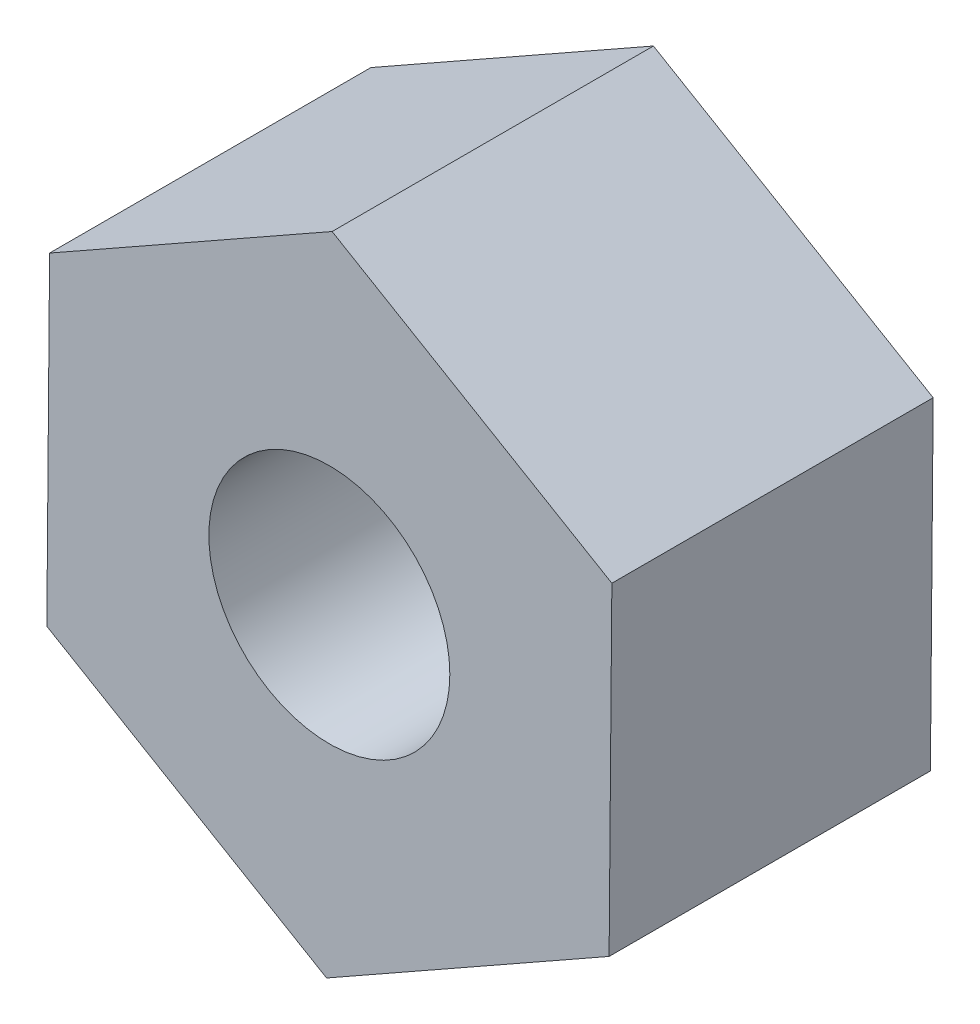
ISO-10303-21;
HEADER;
FILE_DESCRIPTION(('STEP AP214'),'2;1');
FILE_NAME('part.step','',(''),(''),'','','');
FILE_SCHEMA(('AUTOMOTIVE_DESIGN { 1 0 10303 214 1 1 1 1 }'));
ENDSEC;
DATA;
#1=APPLICATION_CONTEXT('core data for automotive mechanical design processes');
#2=APPLICATION_PROTOCOL_DEFINITION('international standard','automotive_design',2000,#1);
#3=PRODUCT_CONTEXT('',#1,'mechanical');
#4=PRODUCT('Part','Part','',(#3));
#5=PRODUCT_RELATED_PRODUCT_CATEGORY('part','',(#4));
#6=PRODUCT_DEFINITION_FORMATION('','',#4);
#7=PRODUCT_DEFINITION_CONTEXT('part definition',#1,'design');
#8=PRODUCT_DEFINITION('design','',#6,#7);
#9=PRODUCT_DEFINITION_SHAPE('','',#8);
#10=(LENGTH_UNIT() NAMED_UNIT(*) SI_UNIT(.MILLI.,.METRE.));
#11=(NAMED_UNIT(*) PLANE_ANGLE_UNIT() SI_UNIT($,.RADIAN.));
#12=(NAMED_UNIT(*) SI_UNIT($,.STERADIAN.) SOLID_ANGLE_UNIT());
#13=UNCERTAINTY_MEASURE_WITH_UNIT(LENGTH_MEASURE(1.E-05),#10,'distance_accuracy_value','');
#14=(GEOMETRIC_REPRESENTATION_CONTEXT(3) GLOBAL_UNCERTAINTY_ASSIGNED_CONTEXT((#13)) GLOBAL_UNIT_ASSIGNED_CONTEXT((#10,
#11,#12)) REPRESENTATION_CONTEXT('',''));
#15=CARTESIAN_POINT('',(0.,0.,0.));
#16=DIRECTION('',(0.,0.,1.));
#17=DIRECTION('',(1.,0.,0.));
#18=AXIS2_PLACEMENT_3D('',#15,#16,#17);
#19=CARTESIAN_POINT('',(0.,0.,4.));
#20=DIRECTION('',(0.,0.,1.));
#21=DIRECTION('',(1.,0.,0.));
#22=AXIS2_PLACEMENT_3D('',#19,#20,#21);
#23=PLANE('',#22);
#24=DIRECTION('',(-0.870254256512063,-0.492602810611792,0.));
#25=VECTOR('',#24,1.);
#26=CARTESIAN_POINT('',(0.0344355152710264,4.04130517637822,4.));
#27=LINE('',#26,#25);
#28=CARTESIAN_POINT('',(0.0344355152710264,4.04130517637822,4.));
#29=VERTEX_POINT('',#28);
#30=CARTESIAN_POINT('',(-3.48265518955357,2.05047461920622,4.));
#31=VERTEX_POINT('',#30);
#32=EDGE_CURVE('E129',#29,#31,#27,.T.);
#33=ORIENTED_EDGE('',*,*,#32,.T.);
#34=DIRECTION('',(-0.00852058029060413,-0.999963699196882,0.));
#35=VECTOR('',#34,1.);
#36=CARTESIAN_POINT('',(-3.48265518955357,2.05047461920622,4.));
#37=LINE('',#36,#35);
#38=CARTESIAN_POINT('',(-3.5170907048246,-1.99083055717199,4.));
#39=VERTEX_POINT('',#38);
#40=EDGE_CURVE('E87',#31,#39,#37,.T.);
#41=ORIENTED_EDGE('',*,*,#40,.T.);
#42=DIRECTION('',(0.861733676221458,-0.507360888585089,0.));
#43=VECTOR('',#42,1.);
#44=CARTESIAN_POINT('',(-3.5170907048246,-1.99083055717199,4.));
#45=LINE('',#44,#43);
#46=CARTESIAN_POINT('',(-0.0344355152710244,-4.04130517637822,4.));
#47=VERTEX_POINT('',#46);
#48=EDGE_CURVE('E100',#39,#47,#45,.T.);
#49=ORIENTED_EDGE('',*,*,#48,.T.);
#50=DIRECTION('',(0.870254256512062,0.492602810611792,0.));
#51=VECTOR('',#50,1.);
#52=CARTESIAN_POINT('',(-0.0344355152710244,-4.04130517637822,4.));
#53=LINE('',#52,#51);
#54=CARTESIAN_POINT('',(3.48265518955357,-2.05047461920622,4.));
#55=VERTEX_POINT('',#54);
#56=EDGE_CURVE('E94',#47,#55,#53,.T.);
#57=ORIENTED_EDGE('',*,*,#56,.T.);
#58=DIRECTION('',(0.00852058029060424,0.999963699196882,0.));
#59=VECTOR('',#58,1.);
#60=CARTESIAN_POINT('',(3.48265518955357,-2.05047461920622,4.));
#61=LINE('',#60,#59);
#62=CARTESIAN_POINT('',(3.5170907048246,1.99083055717199,4.));
#63=VERTEX_POINT('',#62);
#64=EDGE_CURVE('E98',#55,#63,#61,.T.);
#65=ORIENTED_EDGE('',*,*,#64,.T.);
#66=DIRECTION('',(-0.861733676221458,0.507360888585089,0.));
#67=VECTOR('',#66,1.);
#68=CARTESIAN_POINT('',(3.5170907048246,1.99083055717199,4.));
#69=LINE('',#68,#67);
#70=EDGE_CURVE('E50',#63,#29,#69,.T.);
#71=ORIENTED_EDGE('',*,*,#70,.T.);
#72=EDGE_LOOP('',(#33,#41,#49,#57,#65,#71));
#73=FACE_BOUND('',#72,.T.);
#74=CARTESIAN_POINT('',(0.,0.,4.));
#75=DIRECTION('',(0.,0.,1.));
#76=DIRECTION('',(1.,0.,0.));
#77=AXIS2_PLACEMENT_3D('',#74,#75,#76);
#78=CIRCLE('',#77,1.5);
#79=CARTESIAN_POINT('',(1.5,0.,4.));
#80=VERTEX_POINT('',#79);
#81=EDGE_CURVE('E122',#80,#80,#78,.T.);
#82=ORIENTED_EDGE('',*,*,#81,.F.);
#83=EDGE_LOOP('',(#82));
#84=FACE_BOUND('',#83,.T.);
#85=ADVANCED_FACE('F33',(#73,#84),#23,.T.);
#86=CARTESIAN_POINT('',(0.,0.,0.));
#87=DIRECTION('',(0.,0.,1.));
#88=DIRECTION('',(1.,0.,0.));
#89=AXIS2_PLACEMENT_3D('',#86,#87,#88);
#90=PLANE('',#89);
#91=DIRECTION('',(-0.870254256512063,-0.492602810611792,0.));
#92=VECTOR('',#91,1.);
#93=CARTESIAN_POINT('',(0.0344355152710264,4.04130517637822,0.));
#94=LINE('',#93,#92);
#95=CARTESIAN_POINT('',(0.0344355152710264,4.04130517637822,0.));
#96=VERTEX_POINT('',#95);
#97=CARTESIAN_POINT('',(-3.48265518955357,2.05047461920622,0.));
#98=VERTEX_POINT('',#97);
#99=EDGE_CURVE('E118',#96,#98,#94,.T.);
#100=ORIENTED_EDGE('',*,*,#99,.F.);
#101=DIRECTION('',(-0.861733676221458,0.507360888585089,0.));
#102=VECTOR('',#101,1.);
#103=CARTESIAN_POINT('',(3.5170907048246,1.99083055717199,0.));
#104=LINE('',#103,#102);
#105=CARTESIAN_POINT('',(3.5170907048246,1.99083055717199,0.));
#106=VERTEX_POINT('',#105);
#107=EDGE_CURVE('E79',#106,#96,#104,.T.);
#108=ORIENTED_EDGE('',*,*,#107,.F.);
#109=DIRECTION('',(0.00852058029060424,0.999963699196882,0.));
#110=VECTOR('',#109,1.);
#111=CARTESIAN_POINT('',(3.48265518955357,-2.05047461920622,0.));
#112=LINE('',#111,#110);
#113=CARTESIAN_POINT('',(3.48265518955357,-2.05047461920622,0.));
#114=VERTEX_POINT('',#113);
#115=EDGE_CURVE('E73',#114,#106,#112,.T.);
#116=ORIENTED_EDGE('',*,*,#115,.F.);
#117=DIRECTION('',(0.870254256512062,0.492602810611792,0.));
#118=VECTOR('',#117,1.);
#119=CARTESIAN_POINT('',(-0.0344355152710244,-4.04130517637822,0.));
#120=LINE('',#119,#118);
#121=CARTESIAN_POINT('',(-0.0344355152710244,-4.04130517637822,0.));
#122=VERTEX_POINT('',#121);
#123=EDGE_CURVE('E108',#122,#114,#120,.T.);
#124=ORIENTED_EDGE('',*,*,#123,.F.);
#125=DIRECTION('',(0.861733676221458,-0.507360888585089,0.));
#126=VECTOR('',#125,1.);
#127=CARTESIAN_POINT('',(-3.5170907048246,-1.99083055717199,0.));
#128=LINE('',#127,#126);
#129=CARTESIAN_POINT('',(-3.5170907048246,-1.99083055717199,0.));
#130=VERTEX_POINT('',#129);
#131=EDGE_CURVE('E124',#130,#122,#128,.T.);
#132=ORIENTED_EDGE('',*,*,#131,.F.);
#133=DIRECTION('',(-0.00852058029060413,-0.999963699196882,0.));
#134=VECTOR('',#133,1.);
#135=CARTESIAN_POINT('',(-3.48265518955357,2.05047461920622,0.));
#136=LINE('',#135,#134);
#137=EDGE_CURVE('E121',#98,#130,#136,.T.);
#138=ORIENTED_EDGE('',*,*,#137,.F.);
#139=EDGE_LOOP('',(#100,#108,#116,#124,#132,#138));
#140=FACE_BOUND('',#139,.T.);
#141=CARTESIAN_POINT('',(0.,0.,0.));
#142=DIRECTION('',(0.,0.,1.));
#143=DIRECTION('',(1.,0.,0.));
#144=AXIS2_PLACEMENT_3D('',#141,#142,#143);
#145=CIRCLE('',#144,1.5);
#146=CARTESIAN_POINT('',(1.5,0.,0.));
#147=VERTEX_POINT('',#146);
#148=EDGE_CURVE('E222',#147,#147,#145,.T.);
#149=ORIENTED_EDGE('',*,*,#148,.T.);
#150=EDGE_LOOP('',(#149));
#151=FACE_BOUND('',#150,.T.);
#152=ADVANCED_FACE('F138',(#140,#151),#90,.F.);
#153=CARTESIAN_POINT('',(0.0344355152710264,4.04130517637822,4.));
#154=DIRECTION('',(0.492602810611792,-0.870254256512062,0.));
#155=DIRECTION('',(0.870254256512063,0.492602810611792,0.));
#156=AXIS2_PLACEMENT_3D('',#153,#154,#155);
#157=PLANE('',#156);
#158=ORIENTED_EDGE('',*,*,#99,.T.);
#159=DIRECTION('',(0.,0.,-1.));
#160=VECTOR('',#159,1.);
#161=CARTESIAN_POINT('',(-3.48265518955357,2.05047461920622,4.));
#162=LINE('',#161,#160);
#163=EDGE_CURVE('E11',#31,#98,#162,.T.);
#164=ORIENTED_EDGE('',*,*,#163,.F.);
#165=ORIENTED_EDGE('',*,*,#32,.F.);
#166=DIRECTION('',(0.,0.,-1.));
#167=VECTOR('',#166,1.);
#168=CARTESIAN_POINT('',(0.0344355152710264,4.04130517637822,4.));
#169=LINE('',#168,#167);
#170=EDGE_CURVE('E114',#29,#96,#169,.T.);
#171=ORIENTED_EDGE('',*,*,#170,.T.);
#172=EDGE_LOOP('',(#158,#164,#165,#171));
#173=FACE_BOUND('',#172,.T.);
#174=ADVANCED_FACE('F35',(#173),#157,.F.);
#175=CARTESIAN_POINT('',(-3.48265518955357,2.05047461920622,4.));
#176=DIRECTION('',(0.999963699196882,-0.00852058029060413,0.));
#177=DIRECTION('',(0.00852058029060413,0.999963699196882,0.));
#178=AXIS2_PLACEMENT_3D('',#175,#176,#177);
#179=PLANE('',#178);
#180=ORIENTED_EDGE('',*,*,#137,.T.);
#181=DIRECTION('',(0.,0.,-1.));
#182=VECTOR('',#181,1.);
#183=CARTESIAN_POINT('',(-3.5170907048246,-1.99083055717199,4.));
#184=LINE('',#183,#182);
#185=EDGE_CURVE('E42',#39,#130,#184,.T.);
#186=ORIENTED_EDGE('',*,*,#185,.F.);
#187=ORIENTED_EDGE('',*,*,#40,.F.);
#188=ORIENTED_EDGE('',*,*,#163,.T.);
#189=EDGE_LOOP('',(#180,#186,#187,#188));
#190=FACE_BOUND('',#189,.T.);
#191=ADVANCED_FACE('F163',(#190),#179,.F.);
#192=CARTESIAN_POINT('',(-3.5170907048246,-1.99083055717199,4.));
#193=DIRECTION('',(0.507360888585089,0.861733676221458,0.));
#194=DIRECTION('',(-0.861733676221458,0.507360888585089,0.));
#195=AXIS2_PLACEMENT_3D('',#192,#193,#194);
#196=PLANE('',#195);
#197=ORIENTED_EDGE('',*,*,#131,.T.);
#198=DIRECTION('',(0.,0.,-1.));
#199=VECTOR('',#198,1.);
#200=CARTESIAN_POINT('',(-0.0344355152710244,-4.04130517637822,4.));
#201=LINE('',#200,#199);
#202=EDGE_CURVE('E109',#47,#122,#201,.T.);
#203=ORIENTED_EDGE('',*,*,#202,.F.);
#204=ORIENTED_EDGE('',*,*,#48,.F.);
#205=ORIENTED_EDGE('',*,*,#185,.T.);
#206=EDGE_LOOP('',(#197,#203,#204,#205));
#207=FACE_BOUND('',#206,.T.);
#208=ADVANCED_FACE('F135',(#207),#196,.F.);
#209=CARTESIAN_POINT('',(-0.0344355152710244,-4.04130517637822,4.));
#210=DIRECTION('',(-0.492602810611793,0.870254256512062,0.));
#211=DIRECTION('',(-0.870254256512063,-0.492602810611793,0.));
#212=AXIS2_PLACEMENT_3D('',#209,#210,#211);
#213=PLANE('',#212);
#214=ORIENTED_EDGE('',*,*,#123,.T.);
#215=DIRECTION('',(0.,0.,-1.));
#216=VECTOR('',#215,1.);
#217=CARTESIAN_POINT('',(3.48265518955357,-2.05047461920622,4.));
#218=LINE('',#217,#216);
#219=EDGE_CURVE('E105',#55,#114,#218,.T.);
#220=ORIENTED_EDGE('',*,*,#219,.F.);
#221=ORIENTED_EDGE('',*,*,#56,.F.);
#222=ORIENTED_EDGE('',*,*,#202,.T.);
#223=EDGE_LOOP('',(#214,#220,#221,#222));
#224=FACE_BOUND('',#223,.T.);
#225=ADVANCED_FACE('F106',(#224),#213,.F.);
#226=CARTESIAN_POINT('',(3.48265518955357,-2.05047461920622,4.));
#227=DIRECTION('',(-0.999963699196882,0.00852058029060424,0.));
#228=DIRECTION('',(-0.00852058029060424,-0.999963699196882,0.));
#229=AXIS2_PLACEMENT_3D('',#226,#227,#228);
#230=PLANE('',#229);
#231=ORIENTED_EDGE('',*,*,#115,.T.);
#232=DIRECTION('',(0.,0.,-1.));
#233=VECTOR('',#232,1.);
#234=CARTESIAN_POINT('',(3.5170907048246,1.99083055717199,4.));
#235=LINE('',#234,#233);
#236=EDGE_CURVE('E110',#63,#106,#235,.T.);
#237=ORIENTED_EDGE('',*,*,#236,.F.);
#238=ORIENTED_EDGE('',*,*,#64,.F.);
#239=ORIENTED_EDGE('',*,*,#219,.T.);
#240=EDGE_LOOP('',(#231,#237,#238,#239));
#241=FACE_BOUND('',#240,.T.);
#242=ADVANCED_FACE('F112',(#241),#230,.F.);
#243=CARTESIAN_POINT('',(3.5170907048246,1.99083055717199,4.));
#244=DIRECTION('',(-0.507360888585089,-0.861733676221458,0.));
#245=DIRECTION('',(0.861733676221458,-0.507360888585089,0.));
#246=AXIS2_PLACEMENT_3D('',#243,#244,#245);
#247=PLANE('',#246);
#248=ORIENTED_EDGE('',*,*,#107,.T.);
#249=ORIENTED_EDGE('',*,*,#170,.F.);
#250=ORIENTED_EDGE('',*,*,#70,.F.);
#251=ORIENTED_EDGE('',*,*,#236,.T.);
#252=EDGE_LOOP('',(#248,#249,#250,#251));
#253=FACE_BOUND('',#252,.T.);
#254=ADVANCED_FACE('F143',(#253),#247,.F.);
#255=CARTESIAN_POINT('',(0.,0.,4.));
#256=DIRECTION('',(0.,0.,-1.));
#257=DIRECTION('',(-1.,0.,0.));
#258=AXIS2_PLACEMENT_3D('',#255,#256,#257);
#259=CYLINDRICAL_SURFACE('',#258,1.5);
#260=ORIENTED_EDGE('',*,*,#81,.T.);
#261=EDGE_LOOP('',(#260));
#262=FACE_BOUND('',#261,.T.);
#263=ORIENTED_EDGE('',*,*,#148,.F.);
#264=EDGE_LOOP('',(#263));
#265=FACE_BOUND('',#264,.T.);
#266=ADVANCED_FACE('F145',(#262,#265),#259,.F.);
#267=CLOSED_SHELL('',(#85,#152,#174,#191,#208,#225,#242,#254,#266));
#268=MANIFOLD_SOLID_BREP('B2',#267);
#269=ADVANCED_BREP_SHAPE_REPRESENTATION('',(#18,#268),#14);
#270=SHAPE_DEFINITION_REPRESENTATION(#9,#269);
ENDSEC;
END-ISO-10303-21;
